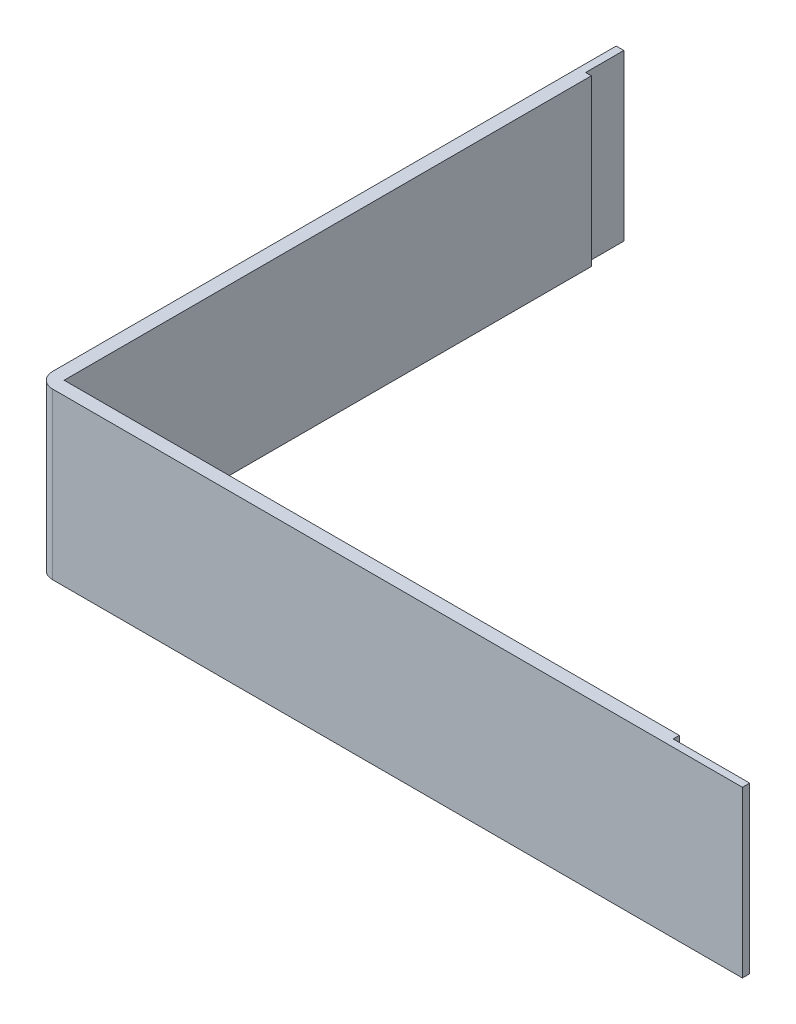
ISO-10303-21;
HEADER;
FILE_DESCRIPTION(('STEP AP214'),'2;1');
FILE_NAME('part.step','',(''),(''),'','','');
FILE_SCHEMA(('AUTOMOTIVE_DESIGN { 1 0 10303 214 1 1 1 1 }'));
ENDSEC;
DATA;
#1=APPLICATION_CONTEXT('core data for automotive mechanical design processes');
#2=APPLICATION_PROTOCOL_DEFINITION('international standard','automotive_design',2000,#1);
#3=PRODUCT_CONTEXT('',#1,'mechanical');
#4=PRODUCT('Part','Part','',(#3));
#5=PRODUCT_RELATED_PRODUCT_CATEGORY('part','',(#4));
#6=PRODUCT_DEFINITION_FORMATION('','',#4);
#7=PRODUCT_DEFINITION_CONTEXT('part definition',#1,'design');
#8=PRODUCT_DEFINITION('design','',#6,#7);
#9=PRODUCT_DEFINITION_SHAPE('','',#8);
#10=(LENGTH_UNIT() NAMED_UNIT(*) SI_UNIT(.MILLI.,.METRE.));
#11=(NAMED_UNIT(*) PLANE_ANGLE_UNIT() SI_UNIT($,.RADIAN.));
#12=(NAMED_UNIT(*) SI_UNIT($,.STERADIAN.) SOLID_ANGLE_UNIT());
#13=UNCERTAINTY_MEASURE_WITH_UNIT(LENGTH_MEASURE(1.E-05),#10,'distance_accuracy_value','');
#14=(GEOMETRIC_REPRESENTATION_CONTEXT(3) GLOBAL_UNCERTAINTY_ASSIGNED_CONTEXT((#13)) GLOBAL_UNIT_ASSIGNED_CONTEXT((#10,
#11,#12)) REPRESENTATION_CONTEXT('',''));
#15=CARTESIAN_POINT('',(0.,0.,0.));
#16=DIRECTION('',(0.,0.,1.));
#17=DIRECTION('',(1.,0.,0.));
#18=AXIS2_PLACEMENT_3D('',#15,#16,#17);
#19=CARTESIAN_POINT('',(-59.9053142990709,0.0460492891376502,152.5));
#20=DIRECTION('',(0.,1.,0.));
#21=DIRECTION('',(0.,0.,1.));
#22=AXIS2_PLACEMENT_3D('',#19,#20,#21);
#23=PLANE('',#22);
#24=CARTESIAN_POINT('',(-59.9053142990709,0.0460492891376502,152.5));
#25=DIRECTION('',(0.,1.,0.));
#26=DIRECTION('',(0.,0.,1.));
#27=AXIS2_PLACEMENT_3D('',#24,#25,#26);
#28=CIRCLE('',#27,2.);
#29=CARTESIAN_POINT('',(-61.9053142990709,0.0460492891376502,152.5));
#30=VERTEX_POINT('',#29);
#31=CARTESIAN_POINT('',(-59.9053142990709,0.0460492891376502,154.5));
#32=VERTEX_POINT('',#31);
#33=EDGE_CURVE('E129',#30,#32,#28,.T.);
#34=ORIENTED_EDGE('',*,*,#33,.F.);
#35=DIRECTION('',(0.,0.,1.));
#36=VECTOR('',#35,1.);
#37=CARTESIAN_POINT('',(-61.9053142990709,0.0460492891376502,78.8000000000001));
#38=LINE('',#37,#36);
#39=CARTESIAN_POINT('',(-61.9053142990709,0.0460492891376502,78.8000000000001));
#40=VERTEX_POINT('',#39);
#41=EDGE_CURVE('E162',#40,#30,#38,.T.);
#42=ORIENTED_EDGE('',*,*,#41,.F.);
#43=DIRECTION('',(-1.,0.,0.));
#44=VECTOR('',#43,1.);
#45=CARTESIAN_POINT('',(-61.9053142990709,0.0460492891376502,78.8000000000001));
#46=LINE('',#45,#44);
#47=CARTESIAN_POINT('',(-60.9053142990709,0.0460492891376502,78.8000000000001));
#48=VERTEX_POINT('',#47);
#49=EDGE_CURVE('E159',#48,#40,#46,.T.);
#50=ORIENTED_EDGE('',*,*,#49,.F.);
#51=DIRECTION('',(0.,0.,-1.));
#52=VECTOR('',#51,1.);
#53=CARTESIAN_POINT('',(-60.9053142990709,0.0460492891376502,78.8000000000001));
#54=LINE('',#53,#52);
#55=CARTESIAN_POINT('',(-60.9053142990709,0.0460492891376502,83.8000000000001));
#56=VERTEX_POINT('',#55);
#57=EDGE_CURVE('E156',#56,#48,#54,.T.);
#58=ORIENTED_EDGE('',*,*,#57,.F.);
#59=DIRECTION('',(-1.,0.,0.));
#60=VECTOR('',#59,1.);
#61=CARTESIAN_POINT('',(-60.9053142990709,0.0460492891376502,83.8000000000001));
#62=LINE('',#61,#60);
#63=CARTESIAN_POINT('',(-60.1553142990709,0.0460492891376502,83.8000000000001));
#64=VERTEX_POINT('',#63);
#65=EDGE_CURVE('E153',#64,#56,#62,.T.);
#66=ORIENTED_EDGE('',*,*,#65,.F.);
#67=DIRECTION('',(0.,0.,-1.));
#68=VECTOR('',#67,1.);
#69=CARTESIAN_POINT('',(-60.1553142990709,0.0460492891376502,83.8000000000001));
#70=LINE('',#69,#68);
#71=CARTESIAN_POINT('',(-60.1553142990709,0.0460492891376502,152.75));
#72=VERTEX_POINT('',#71);
#73=EDGE_CURVE('E150',#72,#64,#70,.T.);
#74=ORIENTED_EDGE('',*,*,#73,.F.);
#75=DIRECTION('',(-1.,0.,0.));
#76=VECTOR('',#75,1.);
#77=CARTESIAN_POINT('',(-60.1553142990709,0.0460492891376502,152.75));
#78=LINE('',#77,#76);
#79=CARTESIAN_POINT('',(20.2946857009291,0.0460492891376502,152.75));
#80=VERTEX_POINT('',#79);
#81=EDGE_CURVE('E147',#80,#72,#78,.T.);
#82=ORIENTED_EDGE('',*,*,#81,.F.);
#83=DIRECTION('',(0.,0.,-1.));
#84=VECTOR('',#83,1.);
#85=CARTESIAN_POINT('',(20.2946857009291,0.0460492891376502,152.75));
#86=LINE('',#85,#84);
#87=CARTESIAN_POINT('',(20.2946857009291,0.0460492891376502,153.55));
#88=VERTEX_POINT('',#87);
#89=EDGE_CURVE('E144',#88,#80,#86,.T.);
#90=ORIENTED_EDGE('',*,*,#89,.F.);
#91=DIRECTION('',(-1.,0.,0.));
#92=VECTOR('',#91,1.);
#93=CARTESIAN_POINT('',(20.2946857009291,0.0460492891376502,153.55));
#94=LINE('',#93,#92);
#95=CARTESIAN_POINT('',(30.2946857009291,0.0460492891376502,153.55));
#96=VERTEX_POINT('',#95);
#97=EDGE_CURVE('E141',#96,#88,#94,.T.);
#98=ORIENTED_EDGE('',*,*,#97,.F.);
#99=DIRECTION('',(0.,0.,-1.));
#100=VECTOR('',#99,1.);
#101=CARTESIAN_POINT('',(30.2946857009291,0.0460492891376502,153.55));
#102=LINE('',#101,#100);
#103=CARTESIAN_POINT('',(30.2946857009291,0.0460492891376502,154.5));
#104=VERTEX_POINT('',#103);
#105=EDGE_CURVE('E132',#104,#96,#102,.T.);
#106=ORIENTED_EDGE('',*,*,#105,.F.);
#107=DIRECTION('',(1.,0.,0.));
#108=VECTOR('',#107,1.);
#109=CARTESIAN_POINT('',(-59.9053142990709,0.0460492891376502,154.5));
#110=LINE('',#109,#108);
#111=EDGE_CURVE('E121',#32,#104,#110,.T.);
#112=ORIENTED_EDGE('',*,*,#111,.F.);
#113=EDGE_LOOP('',(#34,#42,#50,#58,#66,#74,#82,#90,#98,#106,#112));
#114=FACE_BOUND('',#113,.T.);
#115=ADVANCED_FACE('F35',(#114),#23,.F.);
#116=CARTESIAN_POINT('',(-61.9053142990709,141.141187496862,78.8000000000001));
#117=DIRECTION('',(1.,0.,0.));
#118=DIRECTION('',(0.,0.,-1.));
#119=AXIS2_PLACEMENT_3D('',#116,#117,#118);
#120=PLANE('',#119);
#121=DIRECTION('',(0.,-1.,0.));
#122=VECTOR('',#121,1.);
#123=CARTESIAN_POINT('',(-61.9053142990709,141.141187496862,152.5));
#124=LINE('',#123,#122);
#125=CARTESIAN_POINT('',(-61.9053142990709,21.6460492891377,152.5));
#126=VERTEX_POINT('',#125);
#127=EDGE_CURVE('E135',#126,#30,#124,.T.);
#128=ORIENTED_EDGE('',*,*,#127,.F.);
#129=DIRECTION('',(0.,0.,-1.));
#130=VECTOR('',#129,1.);
#131=CARTESIAN_POINT('',(-61.9053142990709,21.6460492891377,78.8000000000001));
#132=LINE('',#131,#130);
#133=CARTESIAN_POINT('',(-61.9053142990709,21.6460492891377,78.8000000000001));
#134=VERTEX_POINT('',#133);
#135=EDGE_CURVE('E39',#126,#134,#132,.T.);
#136=ORIENTED_EDGE('',*,*,#135,.T.);
#137=DIRECTION('',(0.,-1.,0.));
#138=VECTOR('',#137,1.);
#139=CARTESIAN_POINT('',(-61.9053142990709,141.141187496862,78.8000000000001));
#140=LINE('',#139,#138);
#141=EDGE_CURVE('E165',#134,#40,#140,.T.);
#142=ORIENTED_EDGE('',*,*,#141,.T.);
#143=ORIENTED_EDGE('',*,*,#41,.T.);
#144=EDGE_LOOP('',(#128,#136,#142,#143));
#145=FACE_BOUND('',#144,.T.);
#146=ADVANCED_FACE('F209',(#145),#120,.F.);
#147=CARTESIAN_POINT('',(-61.9053142990709,141.141187496862,78.8000000000001));
#148=DIRECTION('',(0.,0.,1.));
#149=DIRECTION('',(1.,0.,0.));
#150=AXIS2_PLACEMENT_3D('',#147,#148,#149);
#151=PLANE('',#150);
#152=ORIENTED_EDGE('',*,*,#141,.F.);
#153=DIRECTION('',(1.,0.,0.));
#154=VECTOR('',#153,1.);
#155=CARTESIAN_POINT('',(-61.9053142990709,21.6460492891377,78.8000000000001));
#156=LINE('',#155,#154);
#157=CARTESIAN_POINT('',(-60.9053142990709,21.6460492891377,78.8000000000001));
#158=VERTEX_POINT('',#157);
#159=EDGE_CURVE('E203',#134,#158,#156,.T.);
#160=ORIENTED_EDGE('',*,*,#159,.T.);
#161=DIRECTION('',(0.,-1.,0.));
#162=VECTOR('',#161,1.);
#163=CARTESIAN_POINT('',(-60.9053142990709,141.141187496862,78.8000000000001));
#164=LINE('',#163,#162);
#165=EDGE_CURVE('E167',#158,#48,#164,.T.);
#166=ORIENTED_EDGE('',*,*,#165,.T.);
#167=ORIENTED_EDGE('',*,*,#49,.T.);
#168=EDGE_LOOP('',(#152,#160,#166,#167));
#169=FACE_BOUND('',#168,.T.);
#170=ADVANCED_FACE('F212',(#169),#151,.F.);
#171=CARTESIAN_POINT('',(-60.9053142990709,141.141187496862,78.8000000000001));
#172=DIRECTION('',(-1.,0.,0.));
#173=DIRECTION('',(0.,0.,1.));
#174=AXIS2_PLACEMENT_3D('',#171,#172,#173);
#175=PLANE('',#174);
#176=ORIENTED_EDGE('',*,*,#165,.F.);
#177=DIRECTION('',(0.,0.,1.));
#178=VECTOR('',#177,1.);
#179=CARTESIAN_POINT('',(-60.9053142990709,21.6460492891377,78.8000000000001));
#180=LINE('',#179,#178);
#181=CARTESIAN_POINT('',(-60.9053142990709,21.6460492891377,83.8000000000001));
#182=VERTEX_POINT('',#181);
#183=EDGE_CURVE('E200',#158,#182,#180,.T.);
#184=ORIENTED_EDGE('',*,*,#183,.T.);
#185=DIRECTION('',(0.,-1.,0.));
#186=VECTOR('',#185,1.);
#187=CARTESIAN_POINT('',(-60.9053142990709,141.141187496862,83.8000000000001));
#188=LINE('',#187,#186);
#189=EDGE_CURVE('E169',#182,#56,#188,.T.);
#190=ORIENTED_EDGE('',*,*,#189,.T.);
#191=ORIENTED_EDGE('',*,*,#57,.T.);
#192=EDGE_LOOP('',(#176,#184,#190,#191));
#193=FACE_BOUND('',#192,.T.);
#194=ADVANCED_FACE('F218',(#193),#175,.F.);
#195=CARTESIAN_POINT('',(-60.9053142990709,141.141187496862,83.8000000000001));
#196=DIRECTION('',(0.,0.,1.));
#197=DIRECTION('',(1.,0.,0.));
#198=AXIS2_PLACEMENT_3D('',#195,#196,#197);
#199=PLANE('',#198);
#200=ORIENTED_EDGE('',*,*,#189,.F.);
#201=DIRECTION('',(1.,0.,0.));
#202=VECTOR('',#201,1.);
#203=CARTESIAN_POINT('',(-60.9053142990709,21.6460492891377,83.8000000000001));
#204=LINE('',#203,#202);
#205=CARTESIAN_POINT('',(-60.1553142990709,21.6460492891377,83.8000000000001));
#206=VERTEX_POINT('',#205);
#207=EDGE_CURVE('E197',#182,#206,#204,.T.);
#208=ORIENTED_EDGE('',*,*,#207,.T.);
#209=DIRECTION('',(0.,-1.,0.));
#210=VECTOR('',#209,1.);
#211=CARTESIAN_POINT('',(-60.1553142990709,141.141187496862,83.8000000000001));
#212=LINE('',#211,#210);
#213=EDGE_CURVE('E171',#206,#64,#212,.T.);
#214=ORIENTED_EDGE('',*,*,#213,.T.);
#215=ORIENTED_EDGE('',*,*,#65,.T.);
#216=EDGE_LOOP('',(#200,#208,#214,#215));
#217=FACE_BOUND('',#216,.T.);
#218=ADVANCED_FACE('F221',(#217),#199,.F.);
#219=CARTESIAN_POINT('',(-60.1553142990709,141.141187496862,83.8000000000001));
#220=DIRECTION('',(-1.,0.,0.));
#221=DIRECTION('',(0.,0.,1.));
#222=AXIS2_PLACEMENT_3D('',#219,#220,#221);
#223=PLANE('',#222);
#224=ORIENTED_EDGE('',*,*,#213,.F.);
#225=DIRECTION('',(0.,0.,1.));
#226=VECTOR('',#225,1.);
#227=CARTESIAN_POINT('',(-60.1553142990709,21.6460492891377,83.8000000000001));
#228=LINE('',#227,#226);
#229=CARTESIAN_POINT('',(-60.1553142990709,21.6460492891377,152.75));
#230=VERTEX_POINT('',#229);
#231=EDGE_CURVE('E194',#206,#230,#228,.T.);
#232=ORIENTED_EDGE('',*,*,#231,.T.);
#233=DIRECTION('',(0.,-1.,0.));
#234=VECTOR('',#233,1.);
#235=CARTESIAN_POINT('',(-60.1553142990709,141.141187496862,152.75));
#236=LINE('',#235,#234);
#237=EDGE_CURVE('E173',#230,#72,#236,.T.);
#238=ORIENTED_EDGE('',*,*,#237,.T.);
#239=ORIENTED_EDGE('',*,*,#73,.T.);
#240=EDGE_LOOP('',(#224,#232,#238,#239));
#241=FACE_BOUND('',#240,.T.);
#242=ADVANCED_FACE('F224',(#241),#223,.F.);
#243=CARTESIAN_POINT('',(-60.1553142990709,141.141187496862,152.75));
#244=DIRECTION('',(0.,0.,1.));
#245=DIRECTION('',(1.,0.,0.));
#246=AXIS2_PLACEMENT_3D('',#243,#244,#245);
#247=PLANE('',#246);
#248=ORIENTED_EDGE('',*,*,#237,.F.);
#249=DIRECTION('',(1.,0.,0.));
#250=VECTOR('',#249,1.);
#251=CARTESIAN_POINT('',(-60.1553142990709,21.6460492891377,152.75));
#252=LINE('',#251,#250);
#253=CARTESIAN_POINT('',(20.2946857009291,21.6460492891377,152.75));
#254=VERTEX_POINT('',#253);
#255=EDGE_CURVE('E191',#230,#254,#252,.T.);
#256=ORIENTED_EDGE('',*,*,#255,.T.);
#257=DIRECTION('',(0.,-1.,0.));
#258=VECTOR('',#257,1.);
#259=CARTESIAN_POINT('',(20.2946857009291,141.141187496862,152.75));
#260=LINE('',#259,#258);
#261=EDGE_CURVE('E175',#254,#80,#260,.T.);
#262=ORIENTED_EDGE('',*,*,#261,.T.);
#263=ORIENTED_EDGE('',*,*,#81,.T.);
#264=EDGE_LOOP('',(#248,#256,#262,#263));
#265=FACE_BOUND('',#264,.T.);
#266=ADVANCED_FACE('F229',(#265),#247,.F.);
#267=CARTESIAN_POINT('',(20.2946857009291,141.141187496862,152.75));
#268=DIRECTION('',(-1.,0.,0.));
#269=DIRECTION('',(0.,0.,1.));
#270=AXIS2_PLACEMENT_3D('',#267,#268,#269);
#271=PLANE('',#270);
#272=ORIENTED_EDGE('',*,*,#261,.F.);
#273=DIRECTION('',(0.,0.,1.));
#274=VECTOR('',#273,1.);
#275=CARTESIAN_POINT('',(20.2946857009291,21.6460492891377,152.75));
#276=LINE('',#275,#274);
#277=CARTESIAN_POINT('',(20.2946857009291,21.6460492891377,153.55));
#278=VERTEX_POINT('',#277);
#279=EDGE_CURVE('E186',#254,#278,#276,.T.);
#280=ORIENTED_EDGE('',*,*,#279,.T.);
#281=DIRECTION('',(0.,-1.,0.));
#282=VECTOR('',#281,1.);
#283=CARTESIAN_POINT('',(20.2946857009291,141.141187496862,153.55));
#284=LINE('',#283,#282);
#285=EDGE_CURVE('E177',#278,#88,#284,.T.);
#286=ORIENTED_EDGE('',*,*,#285,.T.);
#287=ORIENTED_EDGE('',*,*,#89,.T.);
#288=EDGE_LOOP('',(#272,#280,#286,#287));
#289=FACE_BOUND('',#288,.T.);
#290=ADVANCED_FACE('F232',(#289),#271,.F.);
#291=CARTESIAN_POINT('',(20.2946857009291,141.141187496862,153.55));
#292=DIRECTION('',(0.,0.,1.));
#293=DIRECTION('',(1.,0.,0.));
#294=AXIS2_PLACEMENT_3D('',#291,#292,#293);
#295=PLANE('',#294);
#296=ORIENTED_EDGE('',*,*,#285,.F.);
#297=DIRECTION('',(1.,0.,0.));
#298=VECTOR('',#297,1.);
#299=CARTESIAN_POINT('',(20.2946857009291,21.6460492891377,153.55));
#300=LINE('',#299,#298);
#301=CARTESIAN_POINT('',(30.2946857009292,21.6460492891377,153.55));
#302=VERTEX_POINT('',#301);
#303=EDGE_CURVE('E184',#278,#302,#300,.T.);
#304=ORIENTED_EDGE('',*,*,#303,.T.);
#305=DIRECTION('',(0.,-1.,0.));
#306=VECTOR('',#305,1.);
#307=CARTESIAN_POINT('',(30.2946857009291,141.141187496862,153.55));
#308=LINE('',#307,#306);
#309=EDGE_CURVE('E179',#302,#96,#308,.T.);
#310=ORIENTED_EDGE('',*,*,#309,.T.);
#311=ORIENTED_EDGE('',*,*,#97,.T.);
#312=EDGE_LOOP('',(#296,#304,#310,#311));
#313=FACE_BOUND('',#312,.T.);
#314=ADVANCED_FACE('F235',(#313),#295,.F.);
#315=CARTESIAN_POINT('',(30.2946857009291,141.141187496862,153.55));
#316=DIRECTION('',(-1.,0.,0.));
#317=DIRECTION('',(0.,0.,1.));
#318=AXIS2_PLACEMENT_3D('',#315,#316,#317);
#319=PLANE('',#318);
#320=ORIENTED_EDGE('',*,*,#309,.F.);
#321=DIRECTION('',(0.,0.,1.));
#322=VECTOR('',#321,1.);
#323=CARTESIAN_POINT('',(30.2946857009291,21.6460492891377,153.55));
#324=LINE('',#323,#322);
#325=CARTESIAN_POINT('',(30.2946857009291,21.6460492891377,154.5));
#326=VERTEX_POINT('',#325);
#327=EDGE_CURVE('E56',#302,#326,#324,.T.);
#328=ORIENTED_EDGE('',*,*,#327,.T.);
#329=DIRECTION('',(0.,-1.,0.));
#330=VECTOR('',#329,1.);
#331=CARTESIAN_POINT('',(30.2946857009291,141.141187496862,154.5));
#332=LINE('',#331,#330);
#333=EDGE_CURVE('E125',#326,#104,#332,.T.);
#334=ORIENTED_EDGE('',*,*,#333,.T.);
#335=ORIENTED_EDGE('',*,*,#105,.T.);
#336=EDGE_LOOP('',(#320,#328,#334,#335));
#337=FACE_BOUND('',#336,.T.);
#338=ADVANCED_FACE('F182',(#337),#319,.F.);
#339=CARTESIAN_POINT('',(-59.9053142990709,141.141187496862,154.5));
#340=DIRECTION('',(0.,0.,-1.));
#341=DIRECTION('',(-1.,0.,0.));
#342=AXIS2_PLACEMENT_3D('',#339,#340,#341);
#343=PLANE('',#342);
#344=ORIENTED_EDGE('',*,*,#333,.F.);
#345=DIRECTION('',(-1.,0.,0.));
#346=VECTOR('',#345,1.);
#347=CARTESIAN_POINT('',(-59.9053142990709,21.6460492891377,154.5));
#348=LINE('',#347,#346);
#349=CARTESIAN_POINT('',(-59.9053142990709,21.6460492891377,154.5));
#350=VERTEX_POINT('',#349);
#351=EDGE_CURVE('E44',#326,#350,#348,.T.);
#352=ORIENTED_EDGE('',*,*,#351,.T.);
#353=DIRECTION('',(0.,-1.,0.));
#354=VECTOR('',#353,1.);
#355=CARTESIAN_POINT('',(-59.9053142990709,141.141187496862,154.5));
#356=LINE('',#355,#354);
#357=EDGE_CURVE('E118',#350,#32,#356,.T.);
#358=ORIENTED_EDGE('',*,*,#357,.T.);
#359=ORIENTED_EDGE('',*,*,#111,.T.);
#360=EDGE_LOOP('',(#344,#352,#358,#359));
#361=FACE_BOUND('',#360,.T.);
#362=ADVANCED_FACE('F120',(#361),#343,.F.);
#363=CARTESIAN_POINT('',(-59.9053142990709,141.141187496862,152.5));
#364=DIRECTION('',(0.,-1.,0.));
#365=DIRECTION('',(0.,0.,-1.));
#366=AXIS2_PLACEMENT_3D('',#363,#364,#365);
#367=CYLINDRICAL_SURFACE('',#366,2.);
#368=ORIENTED_EDGE('',*,*,#357,.F.);
#369=CARTESIAN_POINT('',(-59.9053142990709,21.6460492891377,152.5));
#370=DIRECTION('',(0.,-1.,0.));
#371=DIRECTION('',(0.,0.,-1.));
#372=AXIS2_PLACEMENT_3D('',#369,#370,#371);
#373=CIRCLE('',#372,2.);
#374=EDGE_CURVE('E12',#350,#126,#373,.T.);
#375=ORIENTED_EDGE('',*,*,#374,.T.);
#376=ORIENTED_EDGE('',*,*,#127,.T.);
#377=ORIENTED_EDGE('',*,*,#33,.T.);
#378=EDGE_LOOP('',(#368,#375,#376,#377));
#379=FACE_BOUND('',#378,.T.);
#380=ADVANCED_FACE('F37',(#379),#367,.T.);
#381=CARTESIAN_POINT('',(-59.9053142990709,21.6460492891377,152.5));
#382=DIRECTION('',(0.,-1.,0.));
#383=DIRECTION('',(0.,0.,-1.));
#384=AXIS2_PLACEMENT_3D('',#381,#382,#383);
#385=PLANE('',#384);
#386=ORIENTED_EDGE('',*,*,#351,.F.);
#387=ORIENTED_EDGE('',*,*,#327,.F.);
#388=ORIENTED_EDGE('',*,*,#303,.F.);
#389=ORIENTED_EDGE('',*,*,#279,.F.);
#390=ORIENTED_EDGE('',*,*,#255,.F.);
#391=ORIENTED_EDGE('',*,*,#231,.F.);
#392=ORIENTED_EDGE('',*,*,#207,.F.);
#393=ORIENTED_EDGE('',*,*,#183,.F.);
#394=ORIENTED_EDGE('',*,*,#159,.F.);
#395=ORIENTED_EDGE('',*,*,#135,.F.);
#396=ORIENTED_EDGE('',*,*,#374,.F.);
#397=EDGE_LOOP('',(#386,#387,#388,#389,#390,#391,#392,#393,#394,#395,#396));
#398=FACE_BOUND('',#397,.T.);
#399=ADVANCED_FACE('F210',(#398),#385,.F.);
#400=CLOSED_SHELL('',(#115,#146,#170,#194,#218,#242,#266,#290,#314,#338,#362,#380,#399));
#401=MANIFOLD_SOLID_BREP('B2',#400);
#402=ADVANCED_BREP_SHAPE_REPRESENTATION('',(#18,#401),#14);
#403=SHAPE_DEFINITION_REPRESENTATION(#9,#402);
ENDSEC;
END-ISO-10303-21;
